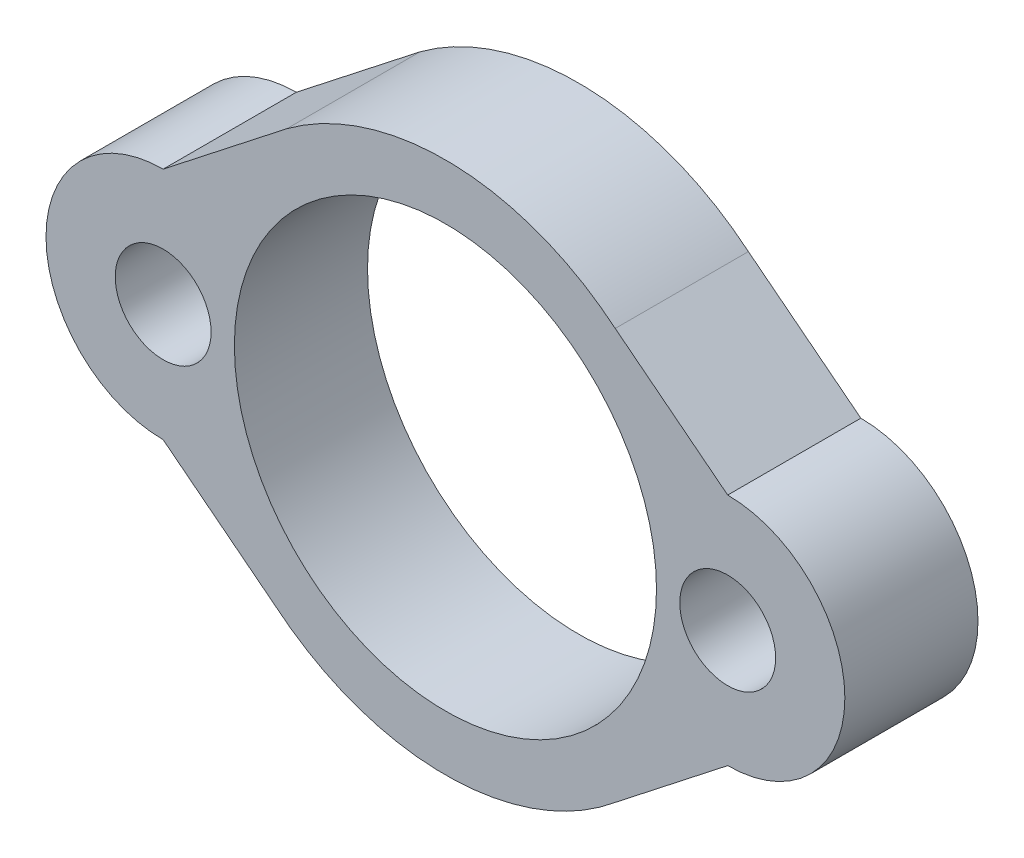
ISO-10303-21;
HEADER;
FILE_DESCRIPTION(('STEP AP214'),'2;1');
FILE_NAME('part.step','',(''),(''),'','','');
FILE_SCHEMA(('AUTOMOTIVE_DESIGN { 1 0 10303 214 1 1 1 1 }'));
ENDSEC;
DATA;
#1=APPLICATION_CONTEXT('core data for automotive mechanical design processes');
#2=APPLICATION_PROTOCOL_DEFINITION('international standard','automotive_design',2000,#1);
#3=PRODUCT_CONTEXT('',#1,'mechanical');
#4=PRODUCT('Part','Part','',(#3));
#5=PRODUCT_RELATED_PRODUCT_CATEGORY('part','',(#4));
#6=PRODUCT_DEFINITION_FORMATION('','',#4);
#7=PRODUCT_DEFINITION_CONTEXT('part definition',#1,'design');
#8=PRODUCT_DEFINITION('design','',#6,#7);
#9=PRODUCT_DEFINITION_SHAPE('','',#8);
#10=(LENGTH_UNIT() NAMED_UNIT(*) SI_UNIT(.MILLI.,.METRE.));
#11=(NAMED_UNIT(*) PLANE_ANGLE_UNIT() SI_UNIT($,.RADIAN.));
#12=(NAMED_UNIT(*) SI_UNIT($,.STERADIAN.) SOLID_ANGLE_UNIT());
#13=UNCERTAINTY_MEASURE_WITH_UNIT(LENGTH_MEASURE(1.E-05),#10,'distance_accuracy_value','');
#14=(GEOMETRIC_REPRESENTATION_CONTEXT(3) GLOBAL_UNCERTAINTY_ASSIGNED_CONTEXT((#13)) GLOBAL_UNIT_ASSIGNED_CONTEXT((#10,
#11,#12)) REPRESENTATION_CONTEXT('',''));
#15=CARTESIAN_POINT('',(0.,0.,0.));
#16=DIRECTION('',(0.,0.,1.));
#17=DIRECTION('',(1.,0.,0.));
#18=AXIS2_PLACEMENT_3D('',#15,#16,#17);
#19=CARTESIAN_POINT('',(-5.21556619172103,-6.6591934788986,3.175));
#20=DIRECTION('',(0.61660321136518,0.787274081711158,0.));
#21=DIRECTION('',(-0.787274081711158,0.61660321136518,0.));
#22=AXIS2_PLACEMENT_3D('',#19,#20,#21);
#23=PLANE('',#22);
#24=DIRECTION('',(0.787274081711159,-0.61660321136518,0.));
#25=VECTOR('',#24,1.);
#26=CARTESIAN_POINT('',(-5.21556619172103,-6.6591934788986,0.));
#27=LINE('',#26,#25);
#28=CARTESIAN_POINT('',(-5.57405324459235,-6.37842179700499,0.));
#29=VERTEX_POINT('',#28);
#30=CARTESIAN_POINT('',(-2.89267694980769,-8.47851028289685,0.));
#31=VERTEX_POINT('',#30);
#32=EDGE_CURVE('E140',#29,#31,#27,.T.);
#33=ORIENTED_EDGE('',*,*,#32,.T.);
#34=DIRECTION('',(0.,0.,-1.));
#35=VECTOR('',#34,1.);
#36=CARTESIAN_POINT('',(-2.89267694980769,-8.47851028289685,3.175));
#37=LINE('',#36,#35);
#38=CARTESIAN_POINT('',(-2.89267694980769,-8.47851028289685,3.175));
#39=VERTEX_POINT('',#38);
#40=EDGE_CURVE('E11',#39,#31,#37,.T.);
#41=ORIENTED_EDGE('',*,*,#40,.F.);
#42=DIRECTION('',(0.787274081711159,-0.61660321136518,0.));
#43=VECTOR('',#42,1.);
#44=CARTESIAN_POINT('',(-5.21556619172103,-6.6591934788986,3.175));
#45=LINE('',#44,#43);
#46=CARTESIAN_POINT('',(-5.57405324459235,-6.37842179700499,3.175));
#47=VERTEX_POINT('',#46);
#48=EDGE_CURVE('E196',#47,#39,#45,.T.);
#49=ORIENTED_EDGE('',*,*,#48,.F.);
#50=DIRECTION('',(0.,0.,-1.));
#51=VECTOR('',#50,1.);
#52=CARTESIAN_POINT('',(-5.57405324459235,-6.37842179700499,3.175));
#53=LINE('',#52,#51);
#54=EDGE_CURVE('E136',#47,#29,#53,.T.);
#55=ORIENTED_EDGE('',*,*,#54,.T.);
#56=EDGE_LOOP('',(#33,#41,#49,#55));
#57=FACE_BOUND('',#56,.T.);
#58=ADVANCED_FACE('F34',(#57),#23,.F.);
#59=CARTESIAN_POINT('',(1.15694675540765,-3.58442179700499,3.175));
#60=DIRECTION('',(0.,0.,-1.));
#61=DIRECTION('',(-1.,0.,0.));
#62=AXIS2_PLACEMENT_3D('',#59,#60,#61);
#63=CYLINDRICAL_SURFACE('',#62,6.35228732517518);
#64=CARTESIAN_POINT('',(1.15694675540765,-3.58442179700499,0.));
#65=DIRECTION('',(0.,0.,1.));
#66=DIRECTION('',(1.,0.,0.));
#67=AXIS2_PLACEMENT_3D('',#64,#65,#66);
#68=CIRCLE('',#67,6.35228732517518);
#69=CARTESIAN_POINT('',(5.20657046062299,-8.47851028289685,0.));
#70=VERTEX_POINT('',#69);
#71=EDGE_CURVE('E143',#31,#70,#68,.T.);
#72=ORIENTED_EDGE('',*,*,#71,.T.);
#73=DIRECTION('',(0.,0.,-1.));
#74=VECTOR('',#73,1.);
#75=CARTESIAN_POINT('',(5.20657046062299,-8.47851028289685,3.175));
#76=LINE('',#75,#74);
#77=CARTESIAN_POINT('',(5.20657046062299,-8.47851028289685,3.175));
#78=VERTEX_POINT('',#77);
#79=EDGE_CURVE('E43',#78,#70,#76,.T.);
#80=ORIENTED_EDGE('',*,*,#79,.F.);
#81=CARTESIAN_POINT('',(1.15694675540765,-3.58442179700499,3.175));
#82=DIRECTION('',(0.,0.,1.));
#83=DIRECTION('',(1.,0.,0.));
#84=AXIS2_PLACEMENT_3D('',#81,#82,#83);
#85=CIRCLE('',#84,6.35228732517518);
#86=EDGE_CURVE('E90',#39,#78,#85,.T.);
#87=ORIENTED_EDGE('',*,*,#86,.F.);
#88=ORIENTED_EDGE('',*,*,#40,.T.);
#89=EDGE_LOOP('',(#72,#80,#87,#88));
#90=FACE_BOUND('',#89,.T.);
#91=ADVANCED_FACE('F177',(#90),#63,.T.);
#92=CARTESIAN_POINT('',(6.09530739447928,-7.78244005753957,3.175));
#93=DIRECTION('',(0.616603211365179,-0.787274081711158,0.));
#94=DIRECTION('',(0.787274081711158,0.616603211365179,0.));
#95=AXIS2_PLACEMENT_3D('',#92,#93,#94);
#96=PLANE('',#95);
#97=DIRECTION('',(-0.787274081711158,-0.616603211365179,0.));
#98=VECTOR('',#97,1.);
#99=CARTESIAN_POINT('',(6.09530739447928,-7.78244005753957,0.));
#100=LINE('',#99,#98);
#101=CARTESIAN_POINT('',(7.88794675540765,-6.37842179700499,0.));
#102=VERTEX_POINT('',#101);
#103=EDGE_CURVE('E146',#102,#70,#100,.T.);
#104=ORIENTED_EDGE('',*,*,#103,.F.);
#105=DIRECTION('',(0.,0.,-1.));
#106=VECTOR('',#105,1.);
#107=CARTESIAN_POINT('',(7.88794675540765,-6.37842179700499,3.175));
#108=LINE('',#107,#106);
#109=CARTESIAN_POINT('',(7.88794675540765,-6.37842179700499,3.175));
#110=VERTEX_POINT('',#109);
#111=EDGE_CURVE('E170',#110,#102,#108,.T.);
#112=ORIENTED_EDGE('',*,*,#111,.F.);
#113=DIRECTION('',(-0.787274081711158,-0.616603211365179,0.));
#114=VECTOR('',#113,1.);
#115=CARTESIAN_POINT('',(6.09530739447928,-7.78244005753957,3.175));
#116=LINE('',#115,#114);
#117=EDGE_CURVE('E176',#110,#78,#116,.T.);
#118=ORIENTED_EDGE('',*,*,#117,.T.);
#119=ORIENTED_EDGE('',*,*,#79,.T.);
#120=EDGE_LOOP('',(#104,#112,#118,#119));
#121=FACE_BOUND('',#120,.T.);
#122=ADVANCED_FACE('F174',(#121),#96,.T.);
#123=CARTESIAN_POINT('',(7.88794675540765,-3.58442179700499,3.175));
#124=DIRECTION('',(0.,0.,-1.));
#125=DIRECTION('',(-1.,0.,0.));
#126=AXIS2_PLACEMENT_3D('',#123,#124,#125);
#127=CYLINDRICAL_SURFACE('',#126,2.794);
#128=CARTESIAN_POINT('',(7.88794675540765,-3.58442179700499,0.));
#129=DIRECTION('',(0.,0.,1.));
#130=DIRECTION('',(1.,0.,0.));
#131=AXIS2_PLACEMENT_3D('',#128,#129,#130);
#132=CIRCLE('',#131,2.794);
#133=CARTESIAN_POINT('',(7.88794675540765,-0.790421797004992,0.));
#134=VERTEX_POINT('',#133);
#135=EDGE_CURVE('E149',#102,#134,#132,.T.);
#136=ORIENTED_EDGE('',*,*,#135,.T.);
#137=DIRECTION('',(0.,0.,-1.));
#138=VECTOR('',#137,1.);
#139=CARTESIAN_POINT('',(7.88794675540765,-0.790421797004992,3.175));
#140=LINE('',#139,#138);
#141=CARTESIAN_POINT('',(7.88794675540765,-0.790421797004992,3.175));
#142=VERTEX_POINT('',#141);
#143=EDGE_CURVE('E167',#142,#134,#140,.T.);
#144=ORIENTED_EDGE('',*,*,#143,.F.);
#145=CARTESIAN_POINT('',(7.88794675540765,-3.58442179700499,3.175));
#146=DIRECTION('',(0.,0.,1.));
#147=DIRECTION('',(1.,0.,0.));
#148=AXIS2_PLACEMENT_3D('',#145,#146,#147);
#149=CIRCLE('',#148,2.794);
#150=EDGE_CURVE('E191',#110,#142,#149,.T.);
#151=ORIENTED_EDGE('',*,*,#150,.F.);
#152=ORIENTED_EDGE('',*,*,#111,.T.);
#153=EDGE_LOOP('',(#136,#144,#151,#152));
#154=FACE_BOUND('',#153,.T.);
#155=ADVANCED_FACE('F187',(#154),#127,.T.);
#156=CARTESIAN_POINT('',(2.61529459261675,3.33918735883311,3.175));
#157=DIRECTION('',(-0.616603211365179,-0.787274081711158,0.));
#158=DIRECTION('',(0.787274081711159,-0.61660321136518,0.));
#159=AXIS2_PLACEMENT_3D('',#156,#157,#158);
#160=PLANE('',#159);
#161=DIRECTION('',(-0.787274081711158,0.61660321136518,0.));
#162=VECTOR('',#161,1.);
#163=CARTESIAN_POINT('',(2.61529459261675,3.33918735883311,0.));
#164=LINE('',#163,#162);
#165=CARTESIAN_POINT('',(5.20657046062299,1.30966668888687,0.));
#166=VERTEX_POINT('',#165);
#167=EDGE_CURVE('E151',#134,#166,#164,.T.);
#168=ORIENTED_EDGE('',*,*,#167,.T.);
#169=DIRECTION('',(0.,0.,-1.));
#170=VECTOR('',#169,1.);
#171=CARTESIAN_POINT('',(5.20657046062299,1.30966668888687,3.175));
#172=LINE('',#171,#170);
#173=CARTESIAN_POINT('',(5.20657046062299,1.30966668888687,3.175));
#174=VERTEX_POINT('',#173);
#175=EDGE_CURVE('E123',#174,#166,#172,.T.);
#176=ORIENTED_EDGE('',*,*,#175,.F.);
#177=DIRECTION('',(-0.787274081711158,0.61660321136518,0.));
#178=VECTOR('',#177,1.);
#179=CARTESIAN_POINT('',(2.61529459261675,3.33918735883311,3.175));
#180=LINE('',#179,#178);
#181=EDGE_CURVE('E110',#142,#174,#180,.T.);
#182=ORIENTED_EDGE('',*,*,#181,.F.);
#183=ORIENTED_EDGE('',*,*,#143,.T.);
#184=EDGE_LOOP('',(#168,#176,#182,#183));
#185=FACE_BOUND('',#184,.T.);
#186=ADVANCED_FACE('F190',(#185),#160,.F.);
#187=CARTESIAN_POINT('',(1.15694675540765,-3.58442179700499,3.175));
#188=DIRECTION('',(0.,0.,-1.));
#189=DIRECTION('',(-1.,0.,0.));
#190=AXIS2_PLACEMENT_3D('',#187,#188,#189);
#191=CYLINDRICAL_SURFACE('',#190,6.35228732517518);
#192=CARTESIAN_POINT('',(1.15694675540765,-3.58442179700499,0.));
#193=DIRECTION('',(0.,0.,1.));
#194=DIRECTION('',(1.,0.,0.));
#195=AXIS2_PLACEMENT_3D('',#192,#193,#194);
#196=CIRCLE('',#195,6.35228732517518);
#197=CARTESIAN_POINT('',(-2.62429032371479,1.51987055483487,0.));
#198=VERTEX_POINT('',#197);
#199=EDGE_CURVE('E119',#166,#198,#196,.T.);
#200=ORIENTED_EDGE('',*,*,#199,.T.);
#201=DIRECTION('',(0.,0.,-1.));
#202=VECTOR('',#201,1.);
#203=CARTESIAN_POINT('',(-2.62429032371479,1.51987055483487,3.175));
#204=LINE('',#203,#202);
#205=CARTESIAN_POINT('',(-2.62429032371479,1.51987055483487,3.175));
#206=VERTEX_POINT('',#205);
#207=EDGE_CURVE('E116',#206,#198,#204,.T.);
#208=ORIENTED_EDGE('',*,*,#207,.F.);
#209=CARTESIAN_POINT('',(1.15694675540765,-3.58442179700499,3.175));
#210=DIRECTION('',(0.,0.,1.));
#211=DIRECTION('',(1.,0.,0.));
#212=AXIS2_PLACEMENT_3D('',#209,#210,#211);
#213=CIRCLE('',#212,6.35228732517518);
#214=EDGE_CURVE('E103',#174,#206,#213,.T.);
#215=ORIENTED_EDGE('',*,*,#214,.F.);
#216=ORIENTED_EDGE('',*,*,#175,.T.);
#217=EDGE_LOOP('',(#200,#208,#215,#216));
#218=FACE_BOUND('',#217,.T.);
#219=ADVANCED_FACE('F117',(#218),#191,.T.);
#220=CARTESIAN_POINT('',(-1.7355533898585,2.21594078019214,3.175));
#221=DIRECTION('',(-0.616603211365179,0.787274081711159,0.));
#222=DIRECTION('',(-0.787274081711159,-0.616603211365179,0.));
#223=AXIS2_PLACEMENT_3D('',#220,#221,#222);
#224=PLANE('',#223);
#225=DIRECTION('',(0.787274081711159,0.616603211365179,0.));
#226=VECTOR('',#225,1.);
#227=CARTESIAN_POINT('',(-1.7355533898585,2.21594078019214,0.));
#228=LINE('',#227,#226);
#229=CARTESIAN_POINT('',(-5.57405324459234,-0.790421797004991,0.));
#230=VERTEX_POINT('',#229);
#231=EDGE_CURVE('E154',#230,#198,#228,.T.);
#232=ORIENTED_EDGE('',*,*,#231,.F.);
#233=DIRECTION('',(0.,0.,-1.));
#234=VECTOR('',#233,1.);
#235=CARTESIAN_POINT('',(-5.57405324459234,-0.790421797004991,3.175));
#236=LINE('',#235,#234);
#237=CARTESIAN_POINT('',(-5.57405324459234,-0.790421797004991,3.175));
#238=VERTEX_POINT('',#237);
#239=EDGE_CURVE('E79',#238,#230,#236,.T.);
#240=ORIENTED_EDGE('',*,*,#239,.F.);
#241=DIRECTION('',(0.787274081711159,0.616603211365179,0.));
#242=VECTOR('',#241,1.);
#243=CARTESIAN_POINT('',(-1.7355533898585,2.21594078019214,3.175));
#244=LINE('',#243,#242);
#245=EDGE_CURVE('E108',#238,#206,#244,.T.);
#246=ORIENTED_EDGE('',*,*,#245,.T.);
#247=ORIENTED_EDGE('',*,*,#207,.T.);
#248=EDGE_LOOP('',(#232,#240,#246,#247));
#249=FACE_BOUND('',#248,.T.);
#250=ADVANCED_FACE('F125',(#249),#224,.T.);
#251=CARTESIAN_POINT('',(-5.57405324459235,-3.58442179700499,3.175));
#252=DIRECTION('',(0.,0.,-1.));
#253=DIRECTION('',(-1.,0.,0.));
#254=AXIS2_PLACEMENT_3D('',#251,#252,#253);
#255=CYLINDRICAL_SURFACE('',#254,1.143);
#256=CARTESIAN_POINT('',(-5.57405324459235,-3.58442179700499,3.175));
#257=DIRECTION('',(0.,0.,1.));
#258=DIRECTION('',(1.,0.,0.));
#259=AXIS2_PLACEMENT_3D('',#256,#257,#258);
#260=CIRCLE('',#259,1.143);
#261=CARTESIAN_POINT('',(-4.43105324459235,-3.58442179700499,3.175));
#262=VERTEX_POINT('',#261);
#263=EDGE_CURVE('E127',#262,#262,#260,.T.);
#264=ORIENTED_EDGE('',*,*,#263,.T.);
#265=EDGE_LOOP('',(#264));
#266=FACE_BOUND('',#265,.T.);
#267=CARTESIAN_POINT('',(-5.57405324459235,-3.58442179700499,0.));
#268=DIRECTION('',(0.,0.,1.));
#269=DIRECTION('',(1.,0.,0.));
#270=AXIS2_PLACEMENT_3D('',#267,#268,#269);
#271=CIRCLE('',#270,1.143);
#272=CARTESIAN_POINT('',(-4.43105324459235,-3.58442179700499,0.));
#273=VERTEX_POINT('',#272);
#274=EDGE_CURVE('E157',#273,#273,#271,.T.);
#275=ORIENTED_EDGE('',*,*,#274,.F.);
#276=EDGE_LOOP('',(#275));
#277=FACE_BOUND('',#276,.T.);
#278=ADVANCED_FACE('F231',(#266,#277),#255,.F.);
#279=CARTESIAN_POINT('',(-5.57405324459235,-3.58442179700499,3.175));
#280=DIRECTION('',(0.,0.,-1.));
#281=DIRECTION('',(-1.,0.,0.));
#282=AXIS2_PLACEMENT_3D('',#279,#280,#281);
#283=CYLINDRICAL_SURFACE('',#282,2.794);
#284=CARTESIAN_POINT('',(-5.57405324459235,-3.58442179700499,0.));
#285=DIRECTION('',(0.,0.,1.));
#286=DIRECTION('',(1.,0.,0.));
#287=AXIS2_PLACEMENT_3D('',#284,#285,#286);
#288=CIRCLE('',#287,2.794);
#289=EDGE_CURVE('E82',#230,#29,#288,.T.);
#290=ORIENTED_EDGE('',*,*,#289,.T.);
#291=ORIENTED_EDGE('',*,*,#54,.F.);
#292=CARTESIAN_POINT('',(-5.57405324459235,-3.58442179700499,3.175));
#293=DIRECTION('',(0.,0.,1.));
#294=DIRECTION('',(1.,0.,0.));
#295=AXIS2_PLACEMENT_3D('',#292,#293,#294);
#296=CIRCLE('',#295,2.794);
#297=EDGE_CURVE('E51',#238,#47,#296,.T.);
#298=ORIENTED_EDGE('',*,*,#297,.F.);
#299=ORIENTED_EDGE('',*,*,#239,.T.);
#300=EDGE_LOOP('',(#290,#291,#298,#299));
#301=FACE_BOUND('',#300,.T.);
#302=ADVANCED_FACE('F232',(#301),#283,.T.);
#303=CARTESIAN_POINT('',(7.88794675540765,-3.58442179700499,3.175));
#304=DIRECTION('',(0.,0.,-1.));
#305=DIRECTION('',(-1.,0.,0.));
#306=AXIS2_PLACEMENT_3D('',#303,#304,#305);
#307=CYLINDRICAL_SURFACE('',#306,1.143);
#308=CARTESIAN_POINT('',(7.88794675540765,-3.58442179700499,3.175));
#309=DIRECTION('',(0.,0.,1.));
#310=DIRECTION('',(1.,0.,0.));
#311=AXIS2_PLACEMENT_3D('',#308,#309,#310);
#312=CIRCLE('',#311,1.143);
#313=CARTESIAN_POINT('',(9.03094675540765,-3.58442179700499,3.175));
#314=VERTEX_POINT('',#313);
#315=EDGE_CURVE('E163',#314,#314,#312,.T.);
#316=ORIENTED_EDGE('',*,*,#315,.T.);
#317=EDGE_LOOP('',(#316));
#318=FACE_BOUND('',#317,.T.);
#319=CARTESIAN_POINT('',(7.88794675540765,-3.58442179700499,0.));
#320=DIRECTION('',(0.,0.,1.));
#321=DIRECTION('',(1.,0.,0.));
#322=AXIS2_PLACEMENT_3D('',#319,#320,#321);
#323=CIRCLE('',#322,1.143);
#324=CARTESIAN_POINT('',(9.03094675540765,-3.58442179700499,0.));
#325=VERTEX_POINT('',#324);
#326=EDGE_CURVE('E137',#325,#325,#323,.T.);
#327=ORIENTED_EDGE('',*,*,#326,.F.);
#328=EDGE_LOOP('',(#327));
#329=FACE_BOUND('',#328,.T.);
#330=ADVANCED_FACE('F36',(#318,#329),#307,.F.);
#331=CARTESIAN_POINT('',(1.15694675540765,-3.58442179700499,3.175));
#332=DIRECTION('',(0.,0.,-1.));
#333=DIRECTION('',(-1.,0.,0.));
#334=AXIS2_PLACEMENT_3D('',#331,#332,#333);
#335=CYLINDRICAL_SURFACE('',#334,5.0330227);
#336=CARTESIAN_POINT('',(1.15694675540765,-3.58442179700499,3.175));
#337=DIRECTION('',(0.,0.,1.));
#338=DIRECTION('',(1.,0.,0.));
#339=AXIS2_PLACEMENT_3D('',#336,#337,#338);
#340=CIRCLE('',#339,5.0330227);
#341=CARTESIAN_POINT('',(6.18996945540765,-3.58442179700499,3.175));
#342=VERTEX_POINT('',#341);
#343=EDGE_CURVE('E133',#342,#342,#340,.T.);
#344=ORIENTED_EDGE('',*,*,#343,.T.);
#345=EDGE_LOOP('',(#344));
#346=FACE_BOUND('',#345,.T.);
#347=CARTESIAN_POINT('',(1.15694675540765,-3.58442179700499,0.));
#348=DIRECTION('',(0.,0.,1.));
#349=DIRECTION('',(1.,0.,0.));
#350=AXIS2_PLACEMENT_3D('',#347,#348,#349);
#351=CIRCLE('',#350,5.0330227);
#352=CARTESIAN_POINT('',(6.18996945540765,-3.58442179700499,0.));
#353=VERTEX_POINT('',#352);
#354=EDGE_CURVE('E160',#353,#353,#351,.T.);
#355=ORIENTED_EDGE('',*,*,#354,.F.);
#356=EDGE_LOOP('',(#355));
#357=FACE_BOUND('',#356,.T.);
#358=ADVANCED_FACE('F204',(#346,#357),#335,.F.);
#359=CARTESIAN_POINT('',(0.,0.,3.175));
#360=DIRECTION('',(0.,0.,1.));
#361=DIRECTION('',(1.,0.,0.));
#362=AXIS2_PLACEMENT_3D('',#359,#360,#361);
#363=PLANE('',#362);
#364=ORIENTED_EDGE('',*,*,#315,.F.);
#365=EDGE_LOOP('',(#364));
#366=FACE_BOUND('',#365,.T.);
#367=ORIENTED_EDGE('',*,*,#48,.T.);
#368=ORIENTED_EDGE('',*,*,#86,.T.);
#369=ORIENTED_EDGE('',*,*,#117,.F.);
#370=ORIENTED_EDGE('',*,*,#150,.T.);
#371=ORIENTED_EDGE('',*,*,#181,.T.);
#372=ORIENTED_EDGE('',*,*,#214,.T.);
#373=ORIENTED_EDGE('',*,*,#245,.F.);
#374=ORIENTED_EDGE('',*,*,#297,.T.);
#375=EDGE_LOOP('',(#367,#368,#369,#370,#371,#372,#373,#374));
#376=FACE_BOUND('',#375,.T.);
#377=ORIENTED_EDGE('',*,*,#263,.F.);
#378=EDGE_LOOP('',(#377));
#379=FACE_BOUND('',#378,.T.);
#380=ORIENTED_EDGE('',*,*,#343,.F.);
#381=EDGE_LOOP('',(#380));
#382=FACE_BOUND('',#381,.T.);
#383=ADVANCED_FACE('F105',(#366,#376,#379,#382),#363,.T.);
#384=CARTESIAN_POINT('',(0.,0.,0.));
#385=DIRECTION('',(0.,0.,1.));
#386=DIRECTION('',(1.,0.,0.));
#387=AXIS2_PLACEMENT_3D('',#384,#385,#386);
#388=PLANE('',#387);
#389=ORIENTED_EDGE('',*,*,#326,.T.);
#390=EDGE_LOOP('',(#389));
#391=FACE_BOUND('',#390,.T.);
#392=ORIENTED_EDGE('',*,*,#32,.F.);
#393=ORIENTED_EDGE('',*,*,#289,.F.);
#394=ORIENTED_EDGE('',*,*,#231,.T.);
#395=ORIENTED_EDGE('',*,*,#199,.F.);
#396=ORIENTED_EDGE('',*,*,#167,.F.);
#397=ORIENTED_EDGE('',*,*,#135,.F.);
#398=ORIENTED_EDGE('',*,*,#103,.T.);
#399=ORIENTED_EDGE('',*,*,#71,.F.);
#400=EDGE_LOOP('',(#392,#393,#394,#395,#396,#397,#398,#399));
#401=FACE_BOUND('',#400,.T.);
#402=ORIENTED_EDGE('',*,*,#274,.T.);
#403=EDGE_LOOP('',(#402));
#404=FACE_BOUND('',#403,.T.);
#405=ORIENTED_EDGE('',*,*,#354,.T.);
#406=EDGE_LOOP('',(#405));
#407=FACE_BOUND('',#406,.T.);
#408=ADVANCED_FACE('F182',(#391,#401,#404,#407),#388,.F.);
#409=CLOSED_SHELL('',(#58,#91,#122,#155,#186,#219,#250,#278,#302,#330,#358,#383,#408));
#410=MANIFOLD_SOLID_BREP('B2',#409);
#411=ADVANCED_BREP_SHAPE_REPRESENTATION('',(#18,#410),#14);
#412=SHAPE_DEFINITION_REPRESENTATION(#9,#411);
ENDSEC;
END-ISO-10303-21;
